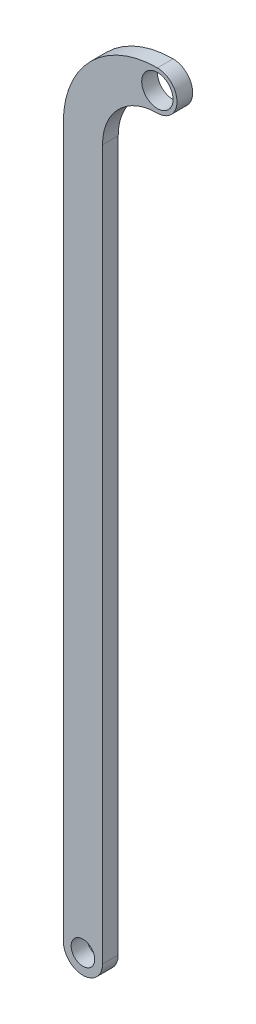
ISO-10303-21;
HEADER;
FILE_DESCRIPTION(('STEP AP214'),'2;1');
FILE_NAME('part.step','',(''),(''),'','','');
FILE_SCHEMA(('AUTOMOTIVE_DESIGN { 1 0 10303 214 1 1 1 1 }'));
ENDSEC;
DATA;
#1=APPLICATION_CONTEXT('core data for automotive mechanical design processes');
#2=APPLICATION_PROTOCOL_DEFINITION('international standard','automotive_design',2000,#1);
#3=PRODUCT_CONTEXT('',#1,'mechanical');
#4=PRODUCT('Part','Part','',(#3));
#5=PRODUCT_RELATED_PRODUCT_CATEGORY('part','',(#4));
#6=PRODUCT_DEFINITION_FORMATION('','',#4);
#7=PRODUCT_DEFINITION_CONTEXT('part definition',#1,'design');
#8=PRODUCT_DEFINITION('design','',#6,#7);
#9=PRODUCT_DEFINITION_SHAPE('','',#8);
#10=(LENGTH_UNIT() NAMED_UNIT(*) SI_UNIT(.MILLI.,.METRE.));
#11=(NAMED_UNIT(*) PLANE_ANGLE_UNIT() SI_UNIT($,.RADIAN.));
#12=(NAMED_UNIT(*) SI_UNIT($,.STERADIAN.) SOLID_ANGLE_UNIT());
#13=UNCERTAINTY_MEASURE_WITH_UNIT(LENGTH_MEASURE(1.E-05),#10,'distance_accuracy_value','');
#14=(GEOMETRIC_REPRESENTATION_CONTEXT(3) GLOBAL_UNCERTAINTY_ASSIGNED_CONTEXT((#13)) GLOBAL_UNIT_ASSIGNED_CONTEXT((#10,
#11,#12)) REPRESENTATION_CONTEXT('',''));
#15=CARTESIAN_POINT('',(0.,0.,0.));
#16=DIRECTION('',(0.,0.,1.));
#17=DIRECTION('',(1.,0.,0.));
#18=AXIS2_PLACEMENT_3D('',#15,#16,#17);
#19=CARTESIAN_POINT('',(0.,-4.75,1.));
#20=DIRECTION('',(0.,0.,1.));
#21=DIRECTION('',(1.,0.,0.));
#22=AXIS2_PLACEMENT_3D('',#19,#20,#21);
#23=PLANE('',#22);
#24=CARTESIAN_POINT('',(0.,0.,1.));
#25=DIRECTION('',(0.,0.,1.));
#26=DIRECTION('',(1.,0.,0.));
#27=AXIS2_PLACEMENT_3D('',#24,#25,#26);
#28=CIRCLE('',#27,1.);
#29=CARTESIAN_POINT('',(1.,0.,1.));
#30=VERTEX_POINT('',#29);
#31=EDGE_CURVE('E123',#30,#30,#28,.T.);
#32=ORIENTED_EDGE('',*,*,#31,.F.);
#33=EDGE_LOOP('',(#32));
#34=FACE_BOUND('',#33,.T.);
#35=CARTESIAN_POINT('',(0.,-4.75,1.));
#36=DIRECTION('',(0.,0.,1.));
#37=DIRECTION('',(1.,0.,0.));
#38=AXIS2_PLACEMENT_3D('',#35,#36,#37);
#39=CIRCLE('',#38,6.);
#40=CARTESIAN_POINT('',(0.,1.25,1.));
#41=VERTEX_POINT('',#40);
#42=CARTESIAN_POINT('',(-6.,-4.75,1.));
#43=VERTEX_POINT('',#42);
#44=EDGE_CURVE('E130',#41,#43,#39,.T.);
#45=ORIENTED_EDGE('',*,*,#44,.T.);
#46=DIRECTION('',(0.,-1.,0.));
#47=VECTOR('',#46,1.);
#48=CARTESIAN_POINT('',(-6.,-4.75,1.));
#49=LINE('',#48,#47);
#50=CARTESIAN_POINT('',(-5.99999999999999,-50.,1.));
#51=VERTEX_POINT('',#50);
#52=EDGE_CURVE('E88',#43,#51,#49,.T.);
#53=ORIENTED_EDGE('',*,*,#52,.T.);
#54=CARTESIAN_POINT('',(-4.75,-50.,1.));
#55=DIRECTION('',(0.,0.,1.));
#56=DIRECTION('',(1.,0.,0.));
#57=AXIS2_PLACEMENT_3D('',#54,#55,#56);
#58=CIRCLE('',#57,1.25);
#59=CARTESIAN_POINT('',(-3.5,-50.,1.));
#60=VERTEX_POINT('',#59);
#61=EDGE_CURVE('E101',#51,#60,#58,.T.);
#62=ORIENTED_EDGE('',*,*,#61,.T.);
#63=DIRECTION('',(0.,1.,0.));
#64=VECTOR('',#63,1.);
#65=CARTESIAN_POINT('',(-3.5,-50.,1.));
#66=LINE('',#65,#64);
#67=CARTESIAN_POINT('',(-3.5,-4.75,1.));
#68=VERTEX_POINT('',#67);
#69=EDGE_CURVE('E95',#60,#68,#66,.T.);
#70=ORIENTED_EDGE('',*,*,#69,.T.);
#71=CARTESIAN_POINT('',(0.,-4.75,1.));
#72=DIRECTION('',(0.,0.,-1.));
#73=DIRECTION('',(1.,0.,0.));
#74=AXIS2_PLACEMENT_3D('',#71,#72,#73);
#75=CIRCLE('',#74,3.5);
#76=CARTESIAN_POINT('',(0.,-1.25,1.));
#77=VERTEX_POINT('',#76);
#78=EDGE_CURVE('E99',#68,#77,#75,.T.);
#79=ORIENTED_EDGE('',*,*,#78,.T.);
#80=CARTESIAN_POINT('',(0.,0.,1.));
#81=DIRECTION('',(0.,0.,1.));
#82=DIRECTION('',(1.,0.,0.));
#83=AXIS2_PLACEMENT_3D('',#80,#81,#82);
#84=CIRCLE('',#83,1.25);
#85=EDGE_CURVE('E51',#77,#41,#84,.T.);
#86=ORIENTED_EDGE('',*,*,#85,.T.);
#87=EDGE_LOOP('',(#45,#53,#62,#70,#79,#86));
#88=FACE_BOUND('',#87,.T.);
#89=CARTESIAN_POINT('',(-4.75,-50.,1.));
#90=DIRECTION('',(0.,0.,1.));
#91=DIRECTION('',(1.,0.,0.));
#92=AXIS2_PLACEMENT_3D('',#89,#90,#91);
#93=CIRCLE('',#92,0.75);
#94=CARTESIAN_POINT('',(-4.,-50.,1.));
#95=VERTEX_POINT('',#94);
#96=EDGE_CURVE('E172',#95,#95,#93,.T.);
#97=ORIENTED_EDGE('',*,*,#96,.F.);
#98=EDGE_LOOP('',(#97));
#99=FACE_BOUND('',#98,.T.);
#100=ADVANCED_FACE('F34',(#34,#88,#99),#23,.T.);
#101=CARTESIAN_POINT('',(0.,-4.75,0.));
#102=DIRECTION('',(0.,0.,1.));
#103=DIRECTION('',(1.,0.,0.));
#104=AXIS2_PLACEMENT_3D('',#101,#102,#103);
#105=PLANE('',#104);
#106=CARTESIAN_POINT('',(0.,-4.75,0.));
#107=DIRECTION('',(0.,0.,1.));
#108=DIRECTION('',(1.,0.,0.));
#109=AXIS2_PLACEMENT_3D('',#106,#107,#108);
#110=CIRCLE('',#109,6.);
#111=CARTESIAN_POINT('',(0.,1.25,0.));
#112=VERTEX_POINT('',#111);
#113=CARTESIAN_POINT('',(-6.,-4.75,0.));
#114=VERTEX_POINT('',#113);
#115=EDGE_CURVE('E119',#112,#114,#110,.T.);
#116=ORIENTED_EDGE('',*,*,#115,.F.);
#117=CARTESIAN_POINT('',(0.,0.,0.));
#118=DIRECTION('',(0.,0.,1.));
#119=DIRECTION('',(1.,0.,0.));
#120=AXIS2_PLACEMENT_3D('',#117,#118,#119);
#121=CIRCLE('',#120,1.25);
#122=CARTESIAN_POINT('',(0.,-1.25,0.));
#123=VERTEX_POINT('',#122);
#124=EDGE_CURVE('E80',#123,#112,#121,.T.);
#125=ORIENTED_EDGE('',*,*,#124,.F.);
#126=CARTESIAN_POINT('',(0.,-4.75,0.));
#127=DIRECTION('',(0.,0.,-1.));
#128=DIRECTION('',(1.,0.,0.));
#129=AXIS2_PLACEMENT_3D('',#126,#127,#128);
#130=CIRCLE('',#129,3.5);
#131=CARTESIAN_POINT('',(-3.5,-4.75,0.));
#132=VERTEX_POINT('',#131);
#133=EDGE_CURVE('E74',#132,#123,#130,.T.);
#134=ORIENTED_EDGE('',*,*,#133,.F.);
#135=DIRECTION('',(0.,1.,0.));
#136=VECTOR('',#135,1.);
#137=CARTESIAN_POINT('',(-3.5,-50.,0.));
#138=LINE('',#137,#136);
#139=CARTESIAN_POINT('',(-3.5,-50.,0.));
#140=VERTEX_POINT('',#139);
#141=EDGE_CURVE('E109',#140,#132,#138,.T.);
#142=ORIENTED_EDGE('',*,*,#141,.F.);
#143=CARTESIAN_POINT('',(-4.75,-50.,0.));
#144=DIRECTION('',(0.,0.,1.));
#145=DIRECTION('',(1.,0.,0.));
#146=AXIS2_PLACEMENT_3D('',#143,#144,#145);
#147=CIRCLE('',#146,1.25);
#148=CARTESIAN_POINT('',(-5.99999999999999,-50.,0.));
#149=VERTEX_POINT('',#148);
#150=EDGE_CURVE('E125',#149,#140,#147,.T.);
#151=ORIENTED_EDGE('',*,*,#150,.F.);
#152=DIRECTION('',(0.,-1.,0.));
#153=VECTOR('',#152,1.);
#154=CARTESIAN_POINT('',(-6.,-4.75,0.));
#155=LINE('',#154,#153);
#156=EDGE_CURVE('E122',#114,#149,#155,.T.);
#157=ORIENTED_EDGE('',*,*,#156,.F.);
#158=EDGE_LOOP('',(#116,#125,#134,#142,#151,#157));
#159=FACE_BOUND('',#158,.T.);
#160=CARTESIAN_POINT('',(0.,0.,0.));
#161=DIRECTION('',(0.,0.,1.));
#162=DIRECTION('',(1.,0.,0.));
#163=AXIS2_PLACEMENT_3D('',#160,#161,#162);
#164=CIRCLE('',#163,1.);
#165=CARTESIAN_POINT('',(1.,0.,0.));
#166=VERTEX_POINT('',#165);
#167=EDGE_CURVE('E178',#166,#166,#164,.T.);
#168=ORIENTED_EDGE('',*,*,#167,.T.);
#169=EDGE_LOOP('',(#168));
#170=FACE_BOUND('',#169,.T.);
#171=CARTESIAN_POINT('',(-4.75,-50.,0.));
#172=DIRECTION('',(0.,0.,1.));
#173=DIRECTION('',(1.,0.,0.));
#174=AXIS2_PLACEMENT_3D('',#171,#172,#173);
#175=CIRCLE('',#174,0.75);
#176=CARTESIAN_POINT('',(-4.,-50.,0.));
#177=VERTEX_POINT('',#176);
#178=EDGE_CURVE('E175',#177,#177,#175,.T.);
#179=ORIENTED_EDGE('',*,*,#178,.T.);
#180=EDGE_LOOP('',(#179));
#181=FACE_BOUND('',#180,.T.);
#182=ADVANCED_FACE('F139',(#159,#170,#181),#105,.F.);
#183=CARTESIAN_POINT('',(0.,-4.75,1.));
#184=DIRECTION('',(0.,0.,-1.));
#185=DIRECTION('',(-1.,0.,0.));
#186=AXIS2_PLACEMENT_3D('',#183,#184,#185);
#187=CYLINDRICAL_SURFACE('',#186,6.);
#188=ORIENTED_EDGE('',*,*,#115,.T.);
#189=DIRECTION('',(0.,0.,-1.));
#190=VECTOR('',#189,1.);
#191=CARTESIAN_POINT('',(-6.,-4.75,1.));
#192=LINE('',#191,#190);
#193=EDGE_CURVE('E11',#43,#114,#192,.T.);
#194=ORIENTED_EDGE('',*,*,#193,.F.);
#195=ORIENTED_EDGE('',*,*,#44,.F.);
#196=DIRECTION('',(0.,0.,-1.));
#197=VECTOR('',#196,1.);
#198=CARTESIAN_POINT('',(0.,1.25,1.));
#199=LINE('',#198,#197);
#200=EDGE_CURVE('E115',#41,#112,#199,.T.);
#201=ORIENTED_EDGE('',*,*,#200,.T.);
#202=EDGE_LOOP('',(#188,#194,#195,#201));
#203=FACE_BOUND('',#202,.T.);
#204=ADVANCED_FACE('F36',(#203),#187,.T.);
#205=CARTESIAN_POINT('',(-6.,-4.75,1.));
#206=DIRECTION('',(1.,0.,0.));
#207=DIRECTION('',(0.,1.,0.));
#208=AXIS2_PLACEMENT_3D('',#205,#206,#207);
#209=PLANE('',#208);
#210=ORIENTED_EDGE('',*,*,#156,.T.);
#211=DIRECTION('',(0.,0.,-1.));
#212=VECTOR('',#211,1.);
#213=CARTESIAN_POINT('',(-5.99999999999999,-50.,1.));
#214=LINE('',#213,#212);
#215=EDGE_CURVE('E43',#51,#149,#214,.T.);
#216=ORIENTED_EDGE('',*,*,#215,.F.);
#217=ORIENTED_EDGE('',*,*,#52,.F.);
#218=ORIENTED_EDGE('',*,*,#193,.T.);
#219=EDGE_LOOP('',(#210,#216,#217,#218));
#220=FACE_BOUND('',#219,.T.);
#221=ADVANCED_FACE('F219',(#220),#209,.F.);
#222=CARTESIAN_POINT('',(-4.75,-50.,1.));
#223=DIRECTION('',(0.,0.,-1.));
#224=DIRECTION('',(-1.,0.,0.));
#225=AXIS2_PLACEMENT_3D('',#222,#223,#224);
#226=CYLINDRICAL_SURFACE('',#225,1.25);
#227=ORIENTED_EDGE('',*,*,#150,.T.);
#228=DIRECTION('',(0.,0.,-1.));
#229=VECTOR('',#228,1.);
#230=CARTESIAN_POINT('',(-3.5,-50.,1.));
#231=LINE('',#230,#229);
#232=EDGE_CURVE('E110',#60,#140,#231,.T.);
#233=ORIENTED_EDGE('',*,*,#232,.F.);
#234=ORIENTED_EDGE('',*,*,#61,.F.);
#235=ORIENTED_EDGE('',*,*,#215,.T.);
#236=EDGE_LOOP('',(#227,#233,#234,#235));
#237=FACE_BOUND('',#236,.T.);
#238=ADVANCED_FACE('F136',(#237),#226,.T.);
#239=CARTESIAN_POINT('',(-3.5,-50.,1.));
#240=DIRECTION('',(-1.,0.,0.));
#241=DIRECTION('',(0.,-1.,0.));
#242=AXIS2_PLACEMENT_3D('',#239,#240,#241);
#243=PLANE('',#242);
#244=ORIENTED_EDGE('',*,*,#141,.T.);
#245=DIRECTION('',(0.,0.,-1.));
#246=VECTOR('',#245,1.);
#247=CARTESIAN_POINT('',(-3.5,-4.75,1.));
#248=LINE('',#247,#246);
#249=EDGE_CURVE('E106',#68,#132,#248,.T.);
#250=ORIENTED_EDGE('',*,*,#249,.F.);
#251=ORIENTED_EDGE('',*,*,#69,.F.);
#252=ORIENTED_EDGE('',*,*,#232,.T.);
#253=EDGE_LOOP('',(#244,#250,#251,#252));
#254=FACE_BOUND('',#253,.T.);
#255=ADVANCED_FACE('F107',(#254),#243,.F.);
#256=CARTESIAN_POINT('',(0.,-4.75,1.));
#257=DIRECTION('',(0.,0.,-1.));
#258=DIRECTION('',(-1.,0.,0.));
#259=AXIS2_PLACEMENT_3D('',#256,#257,#258);
#260=CYLINDRICAL_SURFACE('',#259,3.5);
#261=ORIENTED_EDGE('',*,*,#133,.T.);
#262=DIRECTION('',(0.,0.,-1.));
#263=VECTOR('',#262,1.);
#264=CARTESIAN_POINT('',(0.,-1.25,1.));
#265=LINE('',#264,#263);
#266=EDGE_CURVE('E111',#77,#123,#265,.T.);
#267=ORIENTED_EDGE('',*,*,#266,.F.);
#268=ORIENTED_EDGE('',*,*,#78,.F.);
#269=ORIENTED_EDGE('',*,*,#249,.T.);
#270=EDGE_LOOP('',(#261,#267,#268,#269));
#271=FACE_BOUND('',#270,.T.);
#272=ADVANCED_FACE('F113',(#271),#260,.F.);
#273=CARTESIAN_POINT('',(0.,0.,1.));
#274=DIRECTION('',(0.,0.,-1.));
#275=DIRECTION('',(-1.,0.,0.));
#276=AXIS2_PLACEMENT_3D('',#273,#274,#275);
#277=CYLINDRICAL_SURFACE('',#276,1.25);
#278=ORIENTED_EDGE('',*,*,#124,.T.);
#279=ORIENTED_EDGE('',*,*,#200,.F.);
#280=ORIENTED_EDGE('',*,*,#85,.F.);
#281=ORIENTED_EDGE('',*,*,#266,.T.);
#282=EDGE_LOOP('',(#278,#279,#280,#281));
#283=FACE_BOUND('',#282,.T.);
#284=ADVANCED_FACE('F144',(#283),#277,.T.);
#285=CARTESIAN_POINT('',(0.,0.,1.));
#286=DIRECTION('',(0.,0.,-1.));
#287=DIRECTION('',(-1.,0.,0.));
#288=AXIS2_PLACEMENT_3D('',#285,#286,#287);
#289=CYLINDRICAL_SURFACE('',#288,1.);
#290=ORIENTED_EDGE('',*,*,#31,.T.);
#291=EDGE_LOOP('',(#290));
#292=FACE_BOUND('',#291,.T.);
#293=ORIENTED_EDGE('',*,*,#167,.F.);
#294=EDGE_LOOP('',(#293));
#295=FACE_BOUND('',#294,.T.);
#296=ADVANCED_FACE('F146',(#292,#295),#289,.F.);
#297=CARTESIAN_POINT('',(-4.75,-50.,1.));
#298=DIRECTION('',(0.,0.,-1.));
#299=DIRECTION('',(-1.,0.,0.));
#300=AXIS2_PLACEMENT_3D('',#297,#298,#299);
#301=CYLINDRICAL_SURFACE('',#300,0.75);
#302=ORIENTED_EDGE('',*,*,#96,.T.);
#303=EDGE_LOOP('',(#302));
#304=FACE_BOUND('',#303,.T.);
#305=ORIENTED_EDGE('',*,*,#178,.F.);
#306=EDGE_LOOP('',(#305));
#307=FACE_BOUND('',#306,.T.);
#308=ADVANCED_FACE('F152',(#304,#307),#301,.F.);
#309=CLOSED_SHELL('',(#100,#182,#204,#221,#238,#255,#272,#284,#296,#308));
#310=MANIFOLD_SOLID_BREP('B2',#309);
#311=ADVANCED_BREP_SHAPE_REPRESENTATION('',(#18,#310),#14);
#312=SHAPE_DEFINITION_REPRESENTATION(#9,#311);
ENDSEC;
END-ISO-10303-21;
